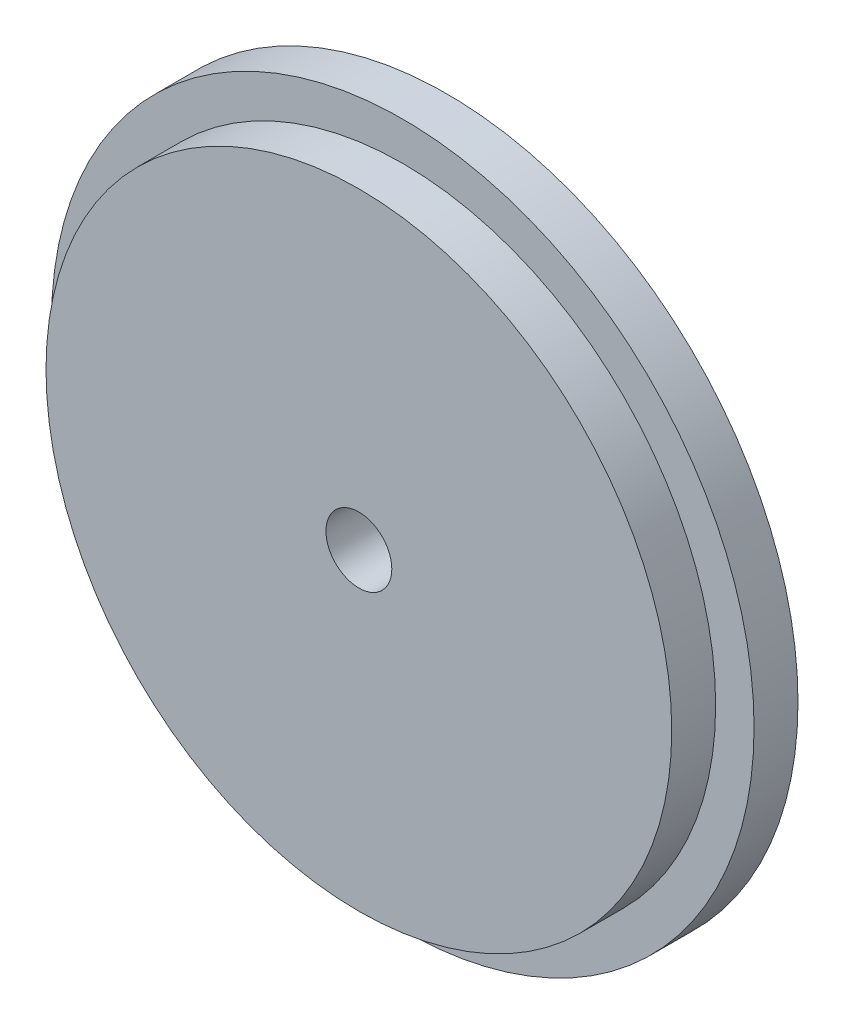
ISO-10303-21;
HEADER;
FILE_DESCRIPTION(('STEP AP214'),'2;1');
FILE_NAME('part.step','',(''),(''),'','','');
FILE_SCHEMA(('AUTOMOTIVE_DESIGN { 1 0 10303 214 1 1 1 1 }'));
ENDSEC;
DATA;
#1=APPLICATION_CONTEXT('core data for automotive mechanical design processes');
#2=APPLICATION_PROTOCOL_DEFINITION('international standard','automotive_design',2000,#1);
#3=PRODUCT_CONTEXT('',#1,'mechanical');
#4=PRODUCT('Part','Part','',(#3));
#5=PRODUCT_RELATED_PRODUCT_CATEGORY('part','',(#4));
#6=PRODUCT_DEFINITION_FORMATION('','',#4);
#7=PRODUCT_DEFINITION_CONTEXT('part definition',#1,'design');
#8=PRODUCT_DEFINITION('design','',#6,#7);
#9=PRODUCT_DEFINITION_SHAPE('','',#8);
#10=(LENGTH_UNIT() NAMED_UNIT(*) SI_UNIT(.MILLI.,.METRE.));
#11=(NAMED_UNIT(*) PLANE_ANGLE_UNIT() SI_UNIT($,.RADIAN.));
#12=(NAMED_UNIT(*) SI_UNIT($,.STERADIAN.) SOLID_ANGLE_UNIT());
#13=UNCERTAINTY_MEASURE_WITH_UNIT(LENGTH_MEASURE(1.E-05),#10,'distance_accuracy_value','');
#14=(GEOMETRIC_REPRESENTATION_CONTEXT(3) GLOBAL_UNCERTAINTY_ASSIGNED_CONTEXT((#13)) GLOBAL_UNIT_ASSIGNED_CONTEXT((#10,
#11,#12)) REPRESENTATION_CONTEXT('',''));
#15=CARTESIAN_POINT('',(0.,0.,0.));
#16=DIRECTION('',(0.,0.,1.));
#17=DIRECTION('',(1.,0.,0.));
#18=AXIS2_PLACEMENT_3D('',#15,#16,#17);
#19=CARTESIAN_POINT('',(0.,0.,2.));
#20=DIRECTION('',(0.,0.,-1.));
#21=DIRECTION('',(-1.,0.,0.));
#22=AXIS2_PLACEMENT_3D('',#19,#20,#21);
#23=CYLINDRICAL_SURFACE('',#22,16.);
#24=CARTESIAN_POINT('',(0.,0.,2.));
#25=DIRECTION('',(0.,0.,1.));
#26=DIRECTION('',(1.,0.,0.));
#27=AXIS2_PLACEMENT_3D('',#24,#25,#26);
#28=CIRCLE('',#27,16.);
#29=CARTESIAN_POINT('',(16.,0.,2.));
#30=VERTEX_POINT('',#29);
#31=EDGE_CURVE('E38',#30,#30,#28,.T.);
#32=ORIENTED_EDGE('',*,*,#31,.F.);
#33=EDGE_LOOP('',(#32));
#34=FACE_BOUND('',#33,.T.);
#35=CARTESIAN_POINT('',(0.,0.,0.));
#36=DIRECTION('',(0.,0.,1.));
#37=DIRECTION('',(1.,0.,0.));
#38=AXIS2_PLACEMENT_3D('',#35,#36,#37);
#39=CIRCLE('',#38,16.);
#40=CARTESIAN_POINT('',(16.,0.,0.));
#41=VERTEX_POINT('',#40);
#42=EDGE_CURVE('E34',#41,#41,#39,.T.);
#43=ORIENTED_EDGE('',*,*,#42,.T.);
#44=EDGE_LOOP('',(#43));
#45=FACE_BOUND('',#44,.T.);
#46=ADVANCED_FACE('F31',(#34,#45),#23,.T.);
#47=CARTESIAN_POINT('',(0.,0.,2.));
#48=DIRECTION('',(0.,0.,1.));
#49=DIRECTION('',(1.,0.,0.));
#50=AXIS2_PLACEMENT_3D('',#47,#48,#49);
#51=PLANE('',#50);
#52=CARTESIAN_POINT('',(0.,0.,2.));
#53=DIRECTION('',(0.,0.,1.));
#54=DIRECTION('',(1.,0.,0.));
#55=AXIS2_PLACEMENT_3D('',#52,#53,#54);
#56=CIRCLE('',#55,14.25);
#57=CARTESIAN_POINT('',(14.25,0.,2.));
#58=VERTEX_POINT('',#57);
#59=EDGE_CURVE('E10',#58,#58,#56,.T.);
#60=ORIENTED_EDGE('',*,*,#59,.F.);
#61=EDGE_LOOP('',(#60));
#62=FACE_BOUND('',#61,.T.);
#63=ORIENTED_EDGE('',*,*,#31,.T.);
#64=EDGE_LOOP('',(#63));
#65=FACE_BOUND('',#64,.T.);
#66=ADVANCED_FACE('F75',(#62,#65),#51,.T.);
#67=CARTESIAN_POINT('',(0.,0.,0.));
#68=DIRECTION('',(0.,0.,1.));
#69=DIRECTION('',(1.,0.,0.));
#70=AXIS2_PLACEMENT_3D('',#67,#68,#69);
#71=PLANE('',#70);
#72=CARTESIAN_POINT('',(0.,0.,0.));
#73=DIRECTION('',(0.,0.,1.));
#74=DIRECTION('',(1.,0.,0.));
#75=AXIS2_PLACEMENT_3D('',#72,#73,#74);
#76=CIRCLE('',#75,1.5);
#77=CARTESIAN_POINT('',(1.5,0.,0.));
#78=VERTEX_POINT('',#77);
#79=EDGE_CURVE('E47',#78,#78,#76,.T.);
#80=ORIENTED_EDGE('',*,*,#79,.T.);
#81=EDGE_LOOP('',(#80));
#82=FACE_BOUND('',#81,.T.);
#83=ORIENTED_EDGE('',*,*,#42,.F.);
#84=EDGE_LOOP('',(#83));
#85=FACE_BOUND('',#84,.T.);
#86=ADVANCED_FACE('F54',(#82,#85),#71,.F.);
#87=CARTESIAN_POINT('',(0.,0.,4.));
#88=DIRECTION('',(0.,0.,-1.));
#89=DIRECTION('',(-1.,0.,0.));
#90=AXIS2_PLACEMENT_3D('',#87,#88,#89);
#91=CYLINDRICAL_SURFACE('',#90,14.25);
#92=CARTESIAN_POINT('',(0.,0.,4.));
#93=DIRECTION('',(0.,0.,1.));
#94=DIRECTION('',(1.,0.,0.));
#95=AXIS2_PLACEMENT_3D('',#92,#93,#94);
#96=CIRCLE('',#95,14.25);
#97=CARTESIAN_POINT('',(14.25,0.,4.));
#98=VERTEX_POINT('',#97);
#99=EDGE_CURVE('E44',#98,#98,#96,.T.);
#100=ORIENTED_EDGE('',*,*,#99,.F.);
#101=EDGE_LOOP('',(#100));
#102=FACE_BOUND('',#101,.T.);
#103=ORIENTED_EDGE('',*,*,#59,.T.);
#104=EDGE_LOOP('',(#103));
#105=FACE_BOUND('',#104,.T.);
#106=ADVANCED_FACE('F66',(#102,#105),#91,.T.);
#107=CARTESIAN_POINT('',(0.,0.,4.));
#108=DIRECTION('',(0.,0.,1.));
#109=DIRECTION('',(1.,0.,0.));
#110=AXIS2_PLACEMENT_3D('',#107,#108,#109);
#111=PLANE('',#110);
#112=CARTESIAN_POINT('',(0.,0.,4.));
#113=DIRECTION('',(0.,0.,1.));
#114=DIRECTION('',(1.,0.,0.));
#115=AXIS2_PLACEMENT_3D('',#112,#113,#114);
#116=CIRCLE('',#115,1.5);
#117=CARTESIAN_POINT('',(1.5,0.,4.));
#118=VERTEX_POINT('',#117);
#119=EDGE_CURVE('E48',#118,#118,#116,.T.);
#120=ORIENTED_EDGE('',*,*,#119,.F.);
#121=EDGE_LOOP('',(#120));
#122=FACE_BOUND('',#121,.T.);
#123=ORIENTED_EDGE('',*,*,#99,.T.);
#124=EDGE_LOOP('',(#123));
#125=FACE_BOUND('',#124,.T.);
#126=ADVANCED_FACE('F60',(#122,#125),#111,.T.);
#127=CARTESIAN_POINT('',(0.,0.,0.));
#128=DIRECTION('',(0.,0.,1.));
#129=DIRECTION('',(1.,0.,0.));
#130=AXIS2_PLACEMENT_3D('',#127,#128,#129);
#131=CYLINDRICAL_SURFACE('',#130,1.5);
#132=ORIENTED_EDGE('',*,*,#79,.F.);
#133=EDGE_LOOP('',(#132));
#134=FACE_BOUND('',#133,.T.);
#135=ORIENTED_EDGE('',*,*,#119,.T.);
#136=EDGE_LOOP('',(#135));
#137=FACE_BOUND('',#136,.T.);
#138=ADVANCED_FACE('F57',(#134,#137),#131,.F.);
#139=CLOSED_SHELL('',(#46,#66,#86,#106,#126,#138));
#140=MANIFOLD_SOLID_BREP('B2',#139);
#141=ADVANCED_BREP_SHAPE_REPRESENTATION('',(#18,#140),#14);
#142=SHAPE_DEFINITION_REPRESENTATION(#9,#141);
ENDSEC;
END-ISO-10303-21;
